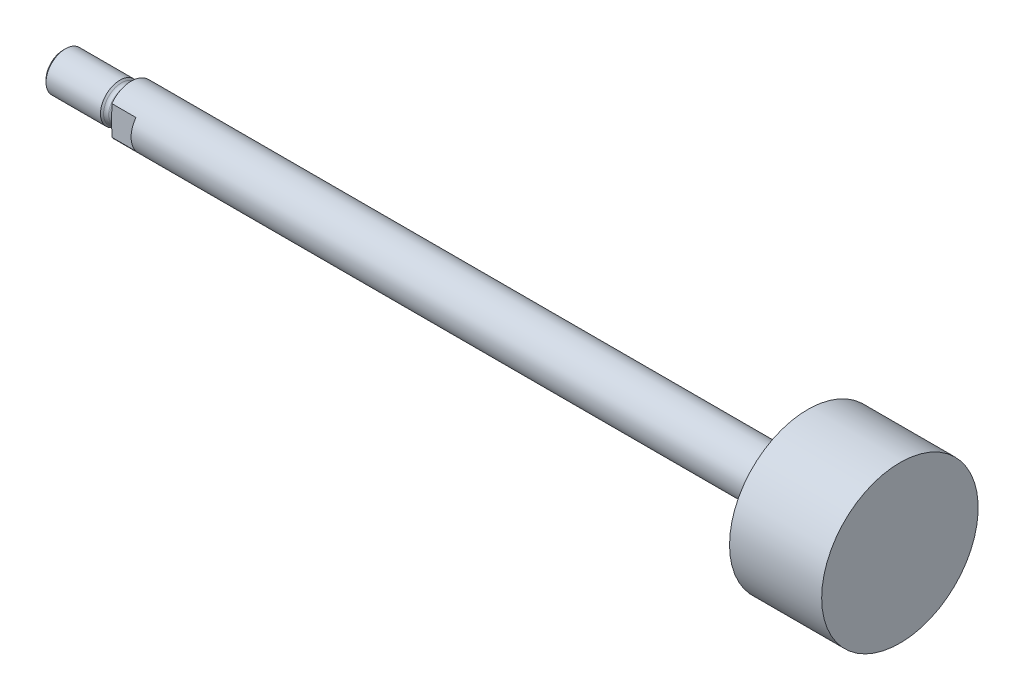
ISO-10303-21;
HEADER;
FILE_DESCRIPTION(('STEP AP214'),'2;1');
FILE_NAME('part.step','',(''),(''),'','','');
FILE_SCHEMA(('AUTOMOTIVE_DESIGN { 1 0 10303 214 1 1 1 1 }'));
ENDSEC;
DATA;
#1=APPLICATION_CONTEXT('core data for automotive mechanical design processes');
#2=APPLICATION_PROTOCOL_DEFINITION('international standard','automotive_design',2000,#1);
#3=PRODUCT_CONTEXT('',#1,'mechanical');
#4=PRODUCT('Part','Part','',(#3));
#5=PRODUCT_RELATED_PRODUCT_CATEGORY('part','',(#4));
#6=PRODUCT_DEFINITION_FORMATION('','',#4);
#7=PRODUCT_DEFINITION_CONTEXT('part definition',#1,'design');
#8=PRODUCT_DEFINITION('design','',#6,#7);
#9=PRODUCT_DEFINITION_SHAPE('','',#8);
#10=(LENGTH_UNIT() NAMED_UNIT(*) SI_UNIT(.MILLI.,.METRE.));
#11=(NAMED_UNIT(*) PLANE_ANGLE_UNIT() SI_UNIT($,.RADIAN.));
#12=(NAMED_UNIT(*) SI_UNIT($,.STERADIAN.) SOLID_ANGLE_UNIT());
#13=UNCERTAINTY_MEASURE_WITH_UNIT(LENGTH_MEASURE(1.E-05),#10,'distance_accuracy_value','');
#14=(GEOMETRIC_REPRESENTATION_CONTEXT(3) GLOBAL_UNCERTAINTY_ASSIGNED_CONTEXT((#13)) GLOBAL_UNIT_ASSIGNED_CONTEXT((#10,
#11,#12)) REPRESENTATION_CONTEXT('',''));
#15=CARTESIAN_POINT('',(0.,0.,0.));
#16=DIRECTION('',(0.,0.,1.));
#17=DIRECTION('',(1.,0.,0.));
#18=AXIS2_PLACEMENT_3D('',#15,#16,#17);
#19=CARTESIAN_POINT('',(-31.75,0.,0.));
#20=DIRECTION('',(1.,0.,0.));
#21=DIRECTION('',(0.,0.,-1.));
#22=AXIS2_PLACEMENT_3D('',#19,#20,#21);
#23=PLANE('',#22);
#24=CARTESIAN_POINT('',(-31.7499999999882,0.,0.));
#25=DIRECTION('',(1.,0.,0.));
#26=DIRECTION('',(0.,1.,0.));
#27=AXIS2_PLACEMENT_3D('',#24,#25,#26);
#28=CIRCLE('',#27,5.59435000002395);
#29=CARTESIAN_POINT('',(-31.7499999999882,5.59435000002395,0.));
#30=VERTEX_POINT('',#29);
#31=EDGE_CURVE('E20',#30,#30,#28,.T.);
#32=ORIENTED_EDGE('',*,*,#31,.F.);
#33=EDGE_LOOP('',(#32));
#34=FACE_BOUND('',#33,.T.);
#35=ADVANCED_FACE('F17',(#34),#23,.F.);
#36=CARTESIAN_POINT('',(-30.9943500001282,0.,0.));
#37=DIRECTION('',(1.,0.,0.));
#38=DIRECTION('',(0.,1.,0.));
#39=AXIS2_PLACEMENT_3D('',#36,#37,#38);
#40=CONICAL_SURFACE('',#39,6.34999999988395,0.785398163397448);
#41=ORIENTED_EDGE('',*,*,#31,.T.);
#42=EDGE_LOOP('',(#41));
#43=FACE_BOUND('',#42,.T.);
#44=CARTESIAN_POINT('',(-30.99435,0.,0.));
#45=DIRECTION('',(-1.,0.,0.));
#46=DIRECTION('',(0.,0.,1.));
#47=AXIS2_PLACEMENT_3D('',#44,#45,#46);
#48=CIRCLE('',#47,6.35);
#49=CARTESIAN_POINT('',(-30.99435,0.,6.35));
#50=VERTEX_POINT('',#49);
#51=EDGE_CURVE('E179',#50,#50,#48,.F.);
#52=ORIENTED_EDGE('',*,*,#51,.F.);
#53=EDGE_LOOP('',(#52));
#54=FACE_BOUND('',#53,.T.);
#55=ADVANCED_FACE('F211',(#43,#54),#40,.T.);
#56=CARTESIAN_POINT('',(-9.525,0.,0.));
#57=DIRECTION('',(-1.,0.,0.));
#58=DIRECTION('',(0.,0.,1.));
#59=AXIS2_PLACEMENT_3D('',#56,#57,#58);
#60=CYLINDRICAL_SURFACE('',#59,6.35);
#61=ORIENTED_EDGE('',*,*,#51,.T.);
#62=EDGE_LOOP('',(#61));
#63=FACE_BOUND('',#62,.T.);
#64=CARTESIAN_POINT('',(-13.2333999999901,0.,0.));
#65=DIRECTION('',(-1.,0.,0.));
#66=DIRECTION('',(0.,0.,1.));
#67=AXIS2_PLACEMENT_3D('',#64,#65,#66);
#68=CIRCLE('',#67,6.34999999999764);
#69=CARTESIAN_POINT('',(-13.2333999999901,0.,6.34999999999764));
#70=VERTEX_POINT('',#69);
#71=EDGE_CURVE('E182',#70,#70,#68,.F.);
#72=ORIENTED_EDGE('',*,*,#71,.F.);
#73=EDGE_LOOP('',(#72));
#74=FACE_BOUND('',#73,.T.);
#75=ADVANCED_FACE('F208',(#63,#74),#60,.T.);
#76=CARTESIAN_POINT('',(-13.2333999998764,0.,0.));
#77=DIRECTION('',(-1.,0.,0.));
#78=DIRECTION('',(0.,0.,1.));
#79=AXIS2_PLACEMENT_3D('',#76,#77,#78);
#80=CONICAL_SURFACE('',#79,6.34999999994079,0.785398163453503);
#81=ORIENTED_EDGE('',*,*,#71,.T.);
#82=EDGE_LOOP('',(#81));
#83=FACE_BOUND('',#82,.T.);
#84=CARTESIAN_POINT('',(-12.726366704261,0.,0.));
#85=DIRECTION('',(1.,0.,0.));
#86=DIRECTION('',(0.,0.,-1.));
#87=AXIS2_PLACEMENT_3D('',#84,#85,#86);
#88=CIRCLE('',#87,5.84296670426099);
#89=CARTESIAN_POINT('',(-12.726366704261,0.,-5.84296670426099));
#90=VERTEX_POINT('',#89);
#91=EDGE_CURVE('E187',#90,#90,#88,.F.);
#92=ORIENTED_EDGE('',*,*,#91,.T.);
#93=EDGE_LOOP('',(#92));
#94=FACE_BOUND('',#93,.T.);
#95=ADVANCED_FACE('F203',(#83,#94),#80,.T.);
#96=CARTESIAN_POINT('',(-11.558933408522,0.,0.));
#97=DIRECTION('',(1.,0.,0.));
#98=DIRECTION('',(0.,0.,-1.));
#99=AXIS2_PLACEMENT_3D('',#96,#97,#98);
#100=TOROIDAL_SURFACE('',#99,7.0104,1.65100000000001);
#101=ORIENTED_EDGE('',*,*,#91,.F.);
#102=EDGE_LOOP('',(#101));
#103=FACE_BOUND('',#102,.T.);
#104=CARTESIAN_POINT('',(-11.558933408522,0.,0.));
#105=DIRECTION('',(-1.,0.,0.));
#106=DIRECTION('',(0.,0.,1.));
#107=AXIS2_PLACEMENT_3D('',#104,#105,#106);
#108=CIRCLE('',#107,5.3594);
#109=CARTESIAN_POINT('',(-11.558933408522,0.,5.3594));
#110=VERTEX_POINT('',#109);
#111=EDGE_CURVE('E192',#110,#110,#108,.F.);
#112=ORIENTED_EDGE('',*,*,#111,.F.);
#113=EDGE_LOOP('',(#112));
#114=FACE_BOUND('',#113,.T.);
#115=ADVANCED_FACE('F198',(#103,#114),#100,.F.);
#116=CARTESIAN_POINT('',(241.173,25.52065,0.));
#117=DIRECTION('',(-1.,0.,0.));
#118=DIRECTION('',(0.,0.,1.));
#119=AXIS2_PLACEMENT_3D('',#116,#117,#118);
#120=PLANE('',#119);
#121=CARTESIAN_POINT('',(241.173,0.,0.));
#122=DIRECTION('',(-1.,0.,0.));
#123=DIRECTION('',(0.,0.,1.));
#124=AXIS2_PLACEMENT_3D('',#121,#122,#123);
#125=CIRCLE('',#124,25.52065);
#126=CARTESIAN_POINT('',(241.173,0.,25.52065));
#127=VERTEX_POINT('',#126);
#128=EDGE_CURVE('E387',#127,#127,#125,.T.);
#129=ORIENTED_EDGE('',*,*,#128,.F.);
#130=EDGE_LOOP('',(#129));
#131=FACE_BOUND('',#130,.T.);
#132=ADVANCED_FACE('F202',(#131),#120,.F.);
#133=CARTESIAN_POINT('',(-9.525,0.,0.));
#134=DIRECTION('',(-1.,0.,0.));
#135=DIRECTION('',(0.,0.,1.));
#136=AXIS2_PLACEMENT_3D('',#133,#134,#135);
#137=CYLINDRICAL_SURFACE('',#136,5.3594);
#138=ORIENTED_EDGE('',*,*,#111,.T.);
#139=EDGE_LOOP('',(#138));
#140=FACE_BOUND('',#139,.T.);
#141=CARTESIAN_POINT('',(-11.176,0.,0.));
#142=DIRECTION('',(1.,0.,0.));
#143=DIRECTION('',(0.,0.,-1.));
#144=AXIS2_PLACEMENT_3D('',#141,#142,#143);
#145=CIRCLE('',#144,5.3594);
#146=CARTESIAN_POINT('',(-11.176,0.,-5.3594));
#147=VERTEX_POINT('',#146);
#148=EDGE_CURVE('E389',#147,#147,#145,.F.);
#149=ORIENTED_EDGE('',*,*,#148,.T.);
#150=EDGE_LOOP('',(#149));
#151=FACE_BOUND('',#150,.T.);
#152=ADVANCED_FACE('F277',(#140,#151),#137,.T.);
#153=CARTESIAN_POINT('',(241.173,0.,0.));
#154=DIRECTION('',(-1.,0.,0.));
#155=DIRECTION('',(0.,0.,1.));
#156=AXIS2_PLACEMENT_3D('',#153,#154,#155);
#157=CYLINDRICAL_SURFACE('',#156,25.52065);
#158=CARTESIAN_POINT('',(211.1248,0.,0.));
#159=DIRECTION('',(-1.,0.,0.));
#160=DIRECTION('',(0.,0.,1.));
#161=AXIS2_PLACEMENT_3D('',#158,#159,#160);
#162=CIRCLE('',#161,25.52065);
#163=CARTESIAN_POINT('',(211.1248,0.,25.52065));
#164=VERTEX_POINT('',#163);
#165=EDGE_CURVE('E91',#164,#164,#162,.F.);
#166=ORIENTED_EDGE('',*,*,#165,.T.);
#167=EDGE_LOOP('',(#166));
#168=FACE_BOUND('',#167,.T.);
#169=ORIENTED_EDGE('',*,*,#128,.T.);
#170=EDGE_LOOP('',(#169));
#171=FACE_BOUND('',#170,.T.);
#172=ADVANCED_FACE('F270',(#168,#171),#157,.T.);
#173=CARTESIAN_POINT('',(-11.176,0.,0.));
#174=DIRECTION('',(1.,0.,0.));
#175=DIRECTION('',(0.,0.,-1.));
#176=AXIS2_PLACEMENT_3D('',#173,#174,#175);
#177=TOROIDAL_SURFACE('',#176,7.0104,1.651);
#178=ORIENTED_EDGE('',*,*,#148,.F.);
#179=EDGE_LOOP('',(#178));
#180=FACE_BOUND('',#179,.T.);
#181=CARTESIAN_POINT('',(-9.525,2.97038855370801,-6.35));
#182=CARTESIAN_POINT('',(-9.52500432717314,2.87856001304067,-6.35));
#183=CARTESIAN_POINT('',(-9.52637466481895,2.78674691580267,-6.35));
#184=CARTESIAN_POINT('',(-9.53125694264594,2.60320136632233,-6.35));
#185=CARTESIAN_POINT('',(-9.53476827720515,2.51146889861821,-6.35));
#186=CARTESIAN_POINT('',(-9.54764417214961,2.23608737385469,-6.35));
#187=CARTESIAN_POINT('',(-9.55934673670103,2.05255650770518,-6.35));
#188=CARTESIAN_POINT('',(-9.5846169660275,1.68545441374015,-6.35));
#189=CARTESIAN_POINT('',(-9.59818655095662,1.50188334117978,-6.35));
#190=CARTESIAN_POINT('',(-9.62318520155134,1.13501829903267,-6.35));
#191=CARTESIAN_POINT('',(-9.63461933357041,0.951724723885822,-6.35));
#192=CARTESIAN_POINT('',(-9.64786787115241,0.676684464035815,-6.35));
#193=CARTESIAN_POINT('',(-9.65163267642366,0.585034676844251,-6.35));
#194=CARTESIAN_POINT('',(-9.65761687588684,0.401685560228313,-6.35));
#195=CARTESIAN_POINT('',(-9.65983630232245,0.309986231877548,-6.35));
#196=CARTESIAN_POINT('',(-9.66256716675136,0.12663024456845,-6.35));
#197=CARTESIAN_POINT('',(-9.66307988474391,0.0349736052032149,-6.35));
#198=CARTESIAN_POINT('',(-9.66236638328493,-0.148332071725467,-6.35));
#199=CARTESIAN_POINT('',(-9.66114017346013,-0.239981109328187,-6.35000000000001));
#200=CARTESIAN_POINT('',(-9.65662353619468,-0.441500345888313,-6.35000000000002));
#201=CARTESIAN_POINT('',(-9.65297047367083,-0.551362349619012,-6.35));
#202=CARTESIAN_POINT('',(-9.64364720433923,-0.771058786420898,-6.35));
#203=CARTESIAN_POINT('',(-9.63797587423027,-0.88089316998469,-6.35));
#204=CARTESIAN_POINT('',(-9.62518265463312,-1.10053620189394,-6.35));
#205=CARTESIAN_POINT('',(-9.61805995669679,-1.2103448015983,-6.35));
#206=CARTESIAN_POINT('',(-9.60308054190903,-1.42994756441094,-6.35));
#207=CARTESIAN_POINT('',(-9.59522357647099,-1.53974170993603,-6.35));
#208=CARTESIAN_POINT('',(-9.57958178368191,-1.75953919720968,-6.35));
#209=CARTESIAN_POINT('',(-9.57179711614879,-1.86954255122618,-6.35));
#210=CARTESIAN_POINT('',(-9.55720939085882,-2.08957585527725,-6.35));
#211=CARTESIAN_POINT('',(-9.55040597696202,-2.19960578107058,-6.35));
#212=CARTESIAN_POINT('',(-9.53871837056633,-2.41972206498445,-6.35));
#213=CARTESIAN_POINT('',(-9.53383322860493,-2.52980836811447,-6.35));
#214=CARTESIAN_POINT('',(-9.52697965054751,-2.75004901434376,-6.35));
#215=CARTESIAN_POINT('',(-9.52501073020114,-2.86020334310726,-6.35));
#216=CARTESIAN_POINT('',(-9.525,-2.97038855370809,-6.35));
#217=B_SPLINE_CURVE_WITH_KNOTS('',3,(#181,#182,#183,#184,#185,#186,#187,#188,#189,#190,#191,
#192,#193,#194,#195,#196,#197,#198,#199,#200,#201,#202,#203,#204,#205,#206,#207,#208,#209,#210,
#211,#212,#213,#214,#215,#216),.UNSPECIFIED.,.F.,.F.,(4,2,2,2,2,2,2,2,2,2,2,2,2,2,2,2,2,4),(0.,
0.275453824117417,0.550829766971975,1.10248801480419,1.65471792159181,2.20562054264102,
2.48079023089343,2.75595417767494,3.03091171012026,3.30586772040328,3.63561237057661,
3.96554083351519,4.29565357971293,4.62587849341643,4.95671259976355,5.28742632811416,
5.61797616036996,5.94847109733863),.UNSPECIFIED.);
#218=CARTESIAN_POINT('',(-9.52499999999963,2.97038855370801,-6.35));
#219=VERTEX_POINT('',#218);
#220=CARTESIAN_POINT('',(-9.525,-2.97038855370809,-6.34999999999999));
#221=VERTEX_POINT('',#220);
#222=EDGE_CURVE('E66',#219,#221,#217,.T.);
#223=ORIENTED_EDGE('',*,*,#222,.T.);
#224=CARTESIAN_POINT('',(-9.525,0.,0.));
#225=DIRECTION('',(-1.,0.,0.));
#226=DIRECTION('',(0.,-0.423711707421558,-0.905797101449275));
#227=AXIS2_PLACEMENT_3D('',#224,#225,#226);
#228=CIRCLE('',#227,7.01039999999997);
#229=CARTESIAN_POINT('',(-9.52499999999982,-2.97038855370801,6.35));
#230=VERTEX_POINT('',#229);
#231=EDGE_CURVE('E79',#221,#230,#228,.T.);
#232=ORIENTED_EDGE('',*,*,#231,.T.);
#233=CARTESIAN_POINT('',(-9.525,-2.97038855370801,6.35));
#234=CARTESIAN_POINT('',(-9.52500432717314,-2.87856001304066,6.35));
#235=CARTESIAN_POINT('',(-9.52637466481895,-2.78674691580267,6.35));
#236=CARTESIAN_POINT('',(-9.53125694264594,-2.60320136632233,6.35));
#237=CARTESIAN_POINT('',(-9.53476827720515,-2.5114688986182,6.35));
#238=CARTESIAN_POINT('',(-9.54764417214961,-2.23608737385469,6.35));
#239=CARTESIAN_POINT('',(-9.55934673670103,-2.05255650770518,6.35));
#240=CARTESIAN_POINT('',(-9.5846169660275,-1.68545441374014,6.35));
#241=CARTESIAN_POINT('',(-9.59818655095662,-1.50188334117978,6.35));
#242=CARTESIAN_POINT('',(-9.62318520155134,-1.13501829903267,6.35));
#243=CARTESIAN_POINT('',(-9.63461933357041,-0.951724723885818,6.35));
#244=CARTESIAN_POINT('',(-9.64786787115241,-0.676684464035811,6.35));
#245=CARTESIAN_POINT('',(-9.65163267642366,-0.585034676844247,6.35));
#246=CARTESIAN_POINT('',(-9.65761687588684,-0.401685560228309,6.35));
#247=CARTESIAN_POINT('',(-9.65983630232245,-0.309986231877544,6.35));
#248=CARTESIAN_POINT('',(-9.66256716675136,-0.126630244568446,6.35));
#249=CARTESIAN_POINT('',(-9.66307988474391,-0.0349736052032102,6.35));
#250=CARTESIAN_POINT('',(-9.66236638328493,0.148332071725471,6.35));
#251=CARTESIAN_POINT('',(-9.66114017346013,0.239981109328192,6.35000000000002));
#252=CARTESIAN_POINT('',(-9.65662353619468,0.441500345888318,6.35000000000002));
#253=CARTESIAN_POINT('',(-9.65297047367083,0.551362349619017,6.35));
#254=CARTESIAN_POINT('',(-9.64364720433923,0.771058786420902,6.34999999999999));
#255=CARTESIAN_POINT('',(-9.63797587423028,0.880893169984694,6.35));
#256=CARTESIAN_POINT('',(-9.62518265463312,1.10053620189394,6.35));
#257=CARTESIAN_POINT('',(-9.61805995669679,1.2103448015983,6.35));
#258=CARTESIAN_POINT('',(-9.60308054190903,1.42994756441094,6.35));
#259=CARTESIAN_POINT('',(-9.595223576471,1.53974170993603,6.35));
#260=CARTESIAN_POINT('',(-9.57958178368191,1.75953919720968,6.35));
#261=CARTESIAN_POINT('',(-9.57179711614879,1.86954255122618,6.35));
#262=CARTESIAN_POINT('',(-9.55720939085882,2.08957585527725,6.35));
#263=CARTESIAN_POINT('',(-9.55040597696202,2.19960578107058,6.35));
#264=CARTESIAN_POINT('',(-9.53871837056633,2.41972206498445,6.35));
#265=CARTESIAN_POINT('',(-9.53383322860493,2.52980836811447,6.35));
#266=CARTESIAN_POINT('',(-9.52697965054751,2.75004901434376,6.35));
#267=CARTESIAN_POINT('',(-9.52501073020114,2.86020334310726,6.35));
#268=CARTESIAN_POINT('',(-9.525,2.97038855370809,6.35));
#269=B_SPLINE_CURVE_WITH_KNOTS('',3,(#233,#234,#235,#236,#237,#238,#239,#240,#241,#242,#243,
#244,#245,#246,#247,#248,#249,#250,#251,#252,#253,#254,#255,#256,#257,#258,#259,#260,#261,#262,
#263,#264,#265,#266,#267,#268),.UNSPECIFIED.,.F.,.F.,(4,2,2,2,2,2,2,2,2,2,2,2,2,2,2,2,2,4),(0.,
0.275453824117417,0.550829766971975,1.10248801480419,1.65471792159181,2.20562054264102,
2.48079023089344,2.75595417767494,3.03091171012026,3.30586772040329,3.63561237057661,
3.96554083351519,4.29565357971293,4.62587849341643,4.95671259976355,5.28742632811416,
5.61797616036996,5.94847109733862),.UNSPECIFIED.);
#270=CARTESIAN_POINT('',(-9.525,2.97038855370809,6.34999999999999));
#271=VERTEX_POINT('',#270);
#272=EDGE_CURVE('E74',#230,#271,#269,.T.);
#273=ORIENTED_EDGE('',*,*,#272,.T.);
#274=CARTESIAN_POINT('',(-9.525,0.,0.));
#275=DIRECTION('',(-1.,0.,0.));
#276=DIRECTION('',(0.,0.423711707421558,0.905797101449275));
#277=AXIS2_PLACEMENT_3D('',#274,#275,#276);
#278=CIRCLE('',#277,7.01039999999997);
#279=EDGE_CURVE('E77',#271,#219,#278,.T.);
#280=ORIENTED_EDGE('',*,*,#279,.T.);
#281=EDGE_LOOP('',(#223,#232,#273,#280));
#282=FACE_BOUND('',#281,.T.);
#283=ADVANCED_FACE('F76',(#180,#282),#177,.F.);
#284=CARTESIAN_POINT('',(211.1248,7.9375,0.));
#285=DIRECTION('',(1.,0.,0.));
#286=DIRECTION('',(0.,0.,-1.));
#287=AXIS2_PLACEMENT_3D('',#284,#285,#286);
#288=PLANE('',#287);
#289=CARTESIAN_POINT('',(211.1248,0.,0.));
#290=DIRECTION('',(-1.,0.,0.));
#291=DIRECTION('',(0.,0.,1.));
#292=AXIS2_PLACEMENT_3D('',#289,#290,#291);
#293=CIRCLE('',#292,7.9375);
#294=CARTESIAN_POINT('',(211.1248,0.,7.9375));
#295=VERTEX_POINT('',#294);
#296=EDGE_CURVE('E110',#295,#295,#293,.T.);
#297=ORIENTED_EDGE('',*,*,#296,.F.);
#298=EDGE_LOOP('',(#297));
#299=FACE_BOUND('',#298,.T.);
#300=ORIENTED_EDGE('',*,*,#165,.F.);
#301=EDGE_LOOP('',(#300));
#302=FACE_BOUND('',#301,.T.);
#303=ADVANCED_FACE('F257',(#299,#302),#288,.F.);
#304=CARTESIAN_POINT('',(-9.525,0.,0.));
#305=DIRECTION('',(1.,0.,0.));
#306=DIRECTION('',(0.,0.,-1.));
#307=AXIS2_PLACEMENT_3D('',#304,#305,#306);
#308=PLANE('',#307);
#309=DIRECTION('',(0.,1.,0.));
#310=VECTOR('',#309,1.);
#311=CARTESIAN_POINT('',(-9.525,7.9375,6.35));
#312=LINE('',#311,#310);
#313=CARTESIAN_POINT('',(-9.525,4.7625,6.35));
#314=VERTEX_POINT('',#313);
#315=EDGE_CURVE('E84',#271,#314,#312,.T.);
#316=ORIENTED_EDGE('',*,*,#315,.T.);
#317=CARTESIAN_POINT('',(-9.52500000000001,0.,0.));
#318=DIRECTION('',(-1.,0.,0.));
#319=DIRECTION('',(0.,0.,1.));
#320=AXIS2_PLACEMENT_3D('',#317,#318,#319);
#321=CIRCLE('',#320,7.9375);
#322=CARTESIAN_POINT('',(-9.525,4.7625,-6.35));
#323=VERTEX_POINT('',#322);
#324=EDGE_CURVE('E57',#323,#314,#321,.F.);
#325=ORIENTED_EDGE('',*,*,#324,.F.);
#326=DIRECTION('',(0.,1.,0.));
#327=VECTOR('',#326,1.);
#328=CARTESIAN_POINT('',(-9.525,-7.9375,-6.35));
#329=LINE('',#328,#327);
#330=EDGE_CURVE('E90',#323,#219,#329,.F.);
#331=ORIENTED_EDGE('',*,*,#330,.T.);
#332=ORIENTED_EDGE('',*,*,#279,.F.);
#333=EDGE_LOOP('',(#316,#325,#331,#332));
#334=FACE_BOUND('',#333,.T.);
#335=ADVANCED_FACE('F88',(#334),#308,.F.);
#336=CARTESIAN_POINT('',(-1.651,0.,0.));
#337=DIRECTION('',(1.,0.,0.));
#338=DIRECTION('',(0.,0.,-1.));
#339=AXIS2_PLACEMENT_3D('',#336,#337,#338);
#340=PLANE('',#339);
#341=CARTESIAN_POINT('',(-1.65100000000001,0.,0.));
#342=DIRECTION('',(-1.,0.,0.));
#343=DIRECTION('',(0.,0.,1.));
#344=AXIS2_PLACEMENT_3D('',#341,#342,#343);
#345=CIRCLE('',#344,7.9375);
#346=CARTESIAN_POINT('',(-1.65100000000001,4.7625,6.35));
#347=VERTEX_POINT('',#346);
#348=CARTESIAN_POINT('',(-1.65100000000001,-4.7625,6.35));
#349=VERTEX_POINT('',#348);
#350=EDGE_CURVE('E106',#347,#349,#345,.F.);
#351=ORIENTED_EDGE('',*,*,#350,.F.);
#352=DIRECTION('',(0.,1.,0.));
#353=VECTOR('',#352,1.);
#354=CARTESIAN_POINT('',(-1.65100000000001,7.9375,6.35));
#355=LINE('',#354,#353);
#356=EDGE_CURVE('E85',#347,#349,#355,.F.);
#357=ORIENTED_EDGE('',*,*,#356,.T.);
#358=EDGE_LOOP('',(#351,#357));
#359=FACE_BOUND('',#358,.T.);
#360=ADVANCED_FACE('F245',(#359),#340,.F.);
#361=CARTESIAN_POINT('',(-1.651,7.9375,6.35));
#362=DIRECTION('',(0.,0.,-1.));
#363=DIRECTION('',(-1.,0.,0.));
#364=AXIS2_PLACEMENT_3D('',#361,#362,#363);
#365=PLANE('',#364);
#366=ORIENTED_EDGE('',*,*,#272,.F.);
#367=DIRECTION('',(0.,1.,0.));
#368=VECTOR('',#367,1.);
#369=CARTESIAN_POINT('',(-9.525,0.,6.35));
#370=LINE('',#369,#368);
#371=CARTESIAN_POINT('',(-9.525,-4.7625,6.35));
#372=VERTEX_POINT('',#371);
#373=EDGE_CURVE('E97',#230,#372,#370,.F.);
#374=ORIENTED_EDGE('',*,*,#373,.T.);
#375=DIRECTION('',(-1.,0.,0.));
#376=VECTOR('',#375,1.);
#377=CARTESIAN_POINT('',(241.173,-4.7625,6.35));
#378=LINE('',#377,#376);
#379=EDGE_CURVE('E102',#349,#372,#378,.T.);
#380=ORIENTED_EDGE('',*,*,#379,.F.);
#381=ORIENTED_EDGE('',*,*,#356,.F.);
#382=DIRECTION('',(-1.,0.,0.));
#383=VECTOR('',#382,1.);
#384=CARTESIAN_POINT('',(241.173,4.7625,6.35));
#385=LINE('',#384,#383);
#386=EDGE_CURVE('E96',#314,#347,#385,.F.);
#387=ORIENTED_EDGE('',*,*,#386,.F.);
#388=ORIENTED_EDGE('',*,*,#315,.F.);
#389=EDGE_LOOP('',(#366,#374,#380,#381,#387,#388));
#390=FACE_BOUND('',#389,.T.);
#391=ADVANCED_FACE('F94',(#390),#365,.F.);
#392=CARTESIAN_POINT('',(-9.525,0.,0.));
#393=DIRECTION('',(1.,0.,0.));
#394=DIRECTION('',(0.,0.,-1.));
#395=AXIS2_PLACEMENT_3D('',#392,#393,#394);
#396=PLANE('',#395);
#397=DIRECTION('',(0.,1.,0.));
#398=VECTOR('',#397,1.);
#399=CARTESIAN_POINT('',(-9.525,-7.9375,-6.35));
#400=LINE('',#399,#398);
#401=CARTESIAN_POINT('',(-9.525,-4.7625,-6.35));
#402=VERTEX_POINT('',#401);
#403=EDGE_CURVE('E113',#221,#402,#400,.F.);
#404=ORIENTED_EDGE('',*,*,#403,.T.);
#405=CARTESIAN_POINT('',(-9.52500000000001,0.,0.));
#406=DIRECTION('',(-1.,0.,0.));
#407=DIRECTION('',(0.,0.,1.));
#408=AXIS2_PLACEMENT_3D('',#405,#406,#407);
#409=CIRCLE('',#408,7.9375);
#410=EDGE_CURVE('E162',#372,#402,#409,.F.);
#411=ORIENTED_EDGE('',*,*,#410,.F.);
#412=ORIENTED_EDGE('',*,*,#373,.F.);
#413=ORIENTED_EDGE('',*,*,#231,.F.);
#414=EDGE_LOOP('',(#404,#411,#412,#413));
#415=FACE_BOUND('',#414,.T.);
#416=ADVANCED_FACE('F139',(#415),#396,.F.);
#417=CARTESIAN_POINT('',(-1.651,0.,0.));
#418=DIRECTION('',(1.,0.,0.));
#419=DIRECTION('',(0.,0.,-1.));
#420=AXIS2_PLACEMENT_3D('',#417,#418,#419);
#421=PLANE('',#420);
#422=CARTESIAN_POINT('',(-1.65100000000001,0.,0.));
#423=DIRECTION('',(-1.,0.,0.));
#424=DIRECTION('',(0.,0.,1.));
#425=AXIS2_PLACEMENT_3D('',#422,#423,#424);
#426=CIRCLE('',#425,7.9375);
#427=CARTESIAN_POINT('',(-1.65100000000001,-4.7625,-6.35));
#428=VERTEX_POINT('',#427);
#429=CARTESIAN_POINT('',(-1.65100000000001,4.7625,-6.35));
#430=VERTEX_POINT('',#429);
#431=EDGE_CURVE('E26',#428,#430,#426,.F.);
#432=ORIENTED_EDGE('',*,*,#431,.F.);
#433=DIRECTION('',(0.,1.,0.));
#434=VECTOR('',#433,1.);
#435=CARTESIAN_POINT('',(-1.65100000000001,-7.9375,-6.35));
#436=LINE('',#435,#434);
#437=EDGE_CURVE('E34',#428,#430,#436,.T.);
#438=ORIENTED_EDGE('',*,*,#437,.T.);
#439=EDGE_LOOP('',(#432,#438));
#440=FACE_BOUND('',#439,.T.);
#441=ADVANCED_FACE('F135',(#440),#421,.F.);
#442=CARTESIAN_POINT('',(-1.651,-7.9375,-6.35));
#443=DIRECTION('',(0.,0.,1.));
#444=DIRECTION('',(1.,0.,0.));
#445=AXIS2_PLACEMENT_3D('',#442,#443,#444);
#446=PLANE('',#445);
#447=ORIENTED_EDGE('',*,*,#222,.F.);
#448=ORIENTED_EDGE('',*,*,#330,.F.);
#449=DIRECTION('',(-1.,0.,0.));
#450=VECTOR('',#449,1.);
#451=CARTESIAN_POINT('',(241.173,4.7625,-6.35));
#452=LINE('',#451,#450);
#453=EDGE_CURVE('E11',#430,#323,#452,.T.);
#454=ORIENTED_EDGE('',*,*,#453,.F.);
#455=ORIENTED_EDGE('',*,*,#437,.F.);
#456=DIRECTION('',(-1.,0.,0.));
#457=VECTOR('',#456,1.);
#458=CARTESIAN_POINT('',(241.173,-4.7625,-6.35));
#459=LINE('',#458,#457);
#460=EDGE_CURVE('E159',#402,#428,#459,.F.);
#461=ORIENTED_EDGE('',*,*,#460,.F.);
#462=ORIENTED_EDGE('',*,*,#403,.F.);
#463=EDGE_LOOP('',(#447,#448,#454,#455,#461,#462));
#464=FACE_BOUND('',#463,.T.);
#465=ADVANCED_FACE('F129',(#464),#446,.F.);
#466=CARTESIAN_POINT('',(241.173,0.,0.));
#467=DIRECTION('',(-1.,0.,0.));
#468=DIRECTION('',(0.,0.,1.));
#469=AXIS2_PLACEMENT_3D('',#466,#467,#468);
#470=CYLINDRICAL_SURFACE('',#469,7.9375);
#471=ORIENTED_EDGE('',*,*,#431,.T.);
#472=ORIENTED_EDGE('',*,*,#453,.T.);
#473=ORIENTED_EDGE('',*,*,#324,.T.);
#474=ORIENTED_EDGE('',*,*,#386,.T.);
#475=ORIENTED_EDGE('',*,*,#350,.T.);
#476=ORIENTED_EDGE('',*,*,#379,.T.);
#477=ORIENTED_EDGE('',*,*,#410,.T.);
#478=ORIENTED_EDGE('',*,*,#460,.T.);
#479=EDGE_LOOP('',(#471,#472,#473,#474,#475,#476,#477,#478));
#480=FACE_BOUND('',#479,.T.);
#481=ORIENTED_EDGE('',*,*,#296,.T.);
#482=EDGE_LOOP('',(#481));
#483=FACE_BOUND('',#482,.T.);
#484=ADVANCED_FACE('F134',(#480,#483),#470,.T.);
#485=CLOSED_SHELL('',(#35,#55,#75,#95,#115,#132,#152,#172,#283,#303,#335,#360,#391,#416,#441,
#465,#484));
#486=MANIFOLD_SOLID_BREP('B1',#485);
#487=ADVANCED_BREP_SHAPE_REPRESENTATION('',(#18,#486),#14);
#488=SHAPE_DEFINITION_REPRESENTATION(#9,#487);
ENDSEC;
END-ISO-10303-21;
